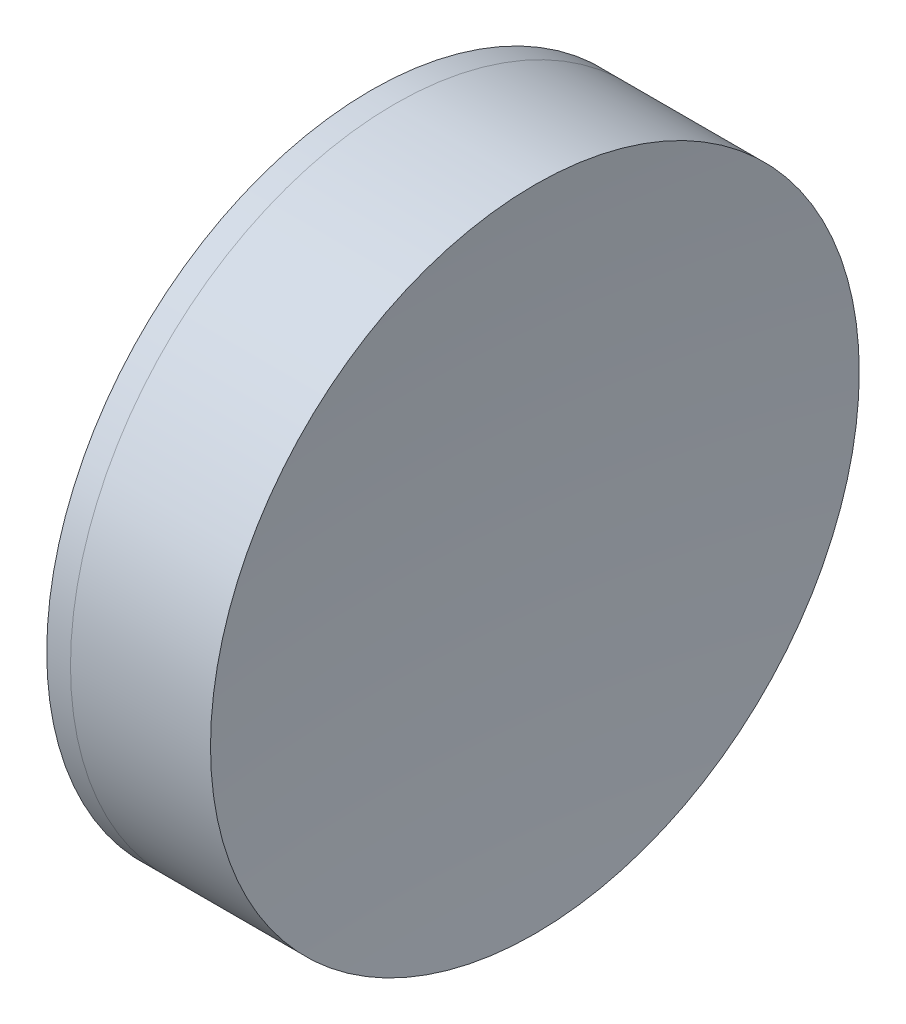
ISO-10303-21;
HEADER;
FILE_DESCRIPTION(('STEP AP214'),'2;1');
FILE_NAME('part.step','',(''),(''),'','','');
FILE_SCHEMA(('AUTOMOTIVE_DESIGN { 1 0 10303 214 1 1 1 1 }'));
ENDSEC;
DATA;
#1=APPLICATION_CONTEXT('core data for automotive mechanical design processes');
#2=APPLICATION_PROTOCOL_DEFINITION('international standard','automotive_design',2000,#1);
#3=PRODUCT_CONTEXT('',#1,'mechanical');
#4=PRODUCT('Part','Part','',(#3));
#5=PRODUCT_RELATED_PRODUCT_CATEGORY('part','',(#4));
#6=PRODUCT_DEFINITION_FORMATION('','',#4);
#7=PRODUCT_DEFINITION_CONTEXT('part definition',#1,'design');
#8=PRODUCT_DEFINITION('design','',#6,#7);
#9=PRODUCT_DEFINITION_SHAPE('','',#8);
#10=(LENGTH_UNIT() NAMED_UNIT(*) SI_UNIT(.MILLI.,.METRE.));
#11=(NAMED_UNIT(*) PLANE_ANGLE_UNIT() SI_UNIT($,.RADIAN.));
#12=(NAMED_UNIT(*) SI_UNIT($,.STERADIAN.) SOLID_ANGLE_UNIT());
#13=UNCERTAINTY_MEASURE_WITH_UNIT(LENGTH_MEASURE(1.E-05),#10,'distance_accuracy_value','');
#14=(GEOMETRIC_REPRESENTATION_CONTEXT(3) GLOBAL_UNCERTAINTY_ASSIGNED_CONTEXT((#13)) GLOBAL_UNIT_ASSIGNED_CONTEXT((#10,
#11,#12)) REPRESENTATION_CONTEXT('',''));
#15=CARTESIAN_POINT('',(0.,0.,0.));
#16=DIRECTION('',(0.,0.,1.));
#17=DIRECTION('',(1.,0.,0.));
#18=AXIS2_PLACEMENT_3D('',#15,#16,#17);
#19=CARTESIAN_POINT('',(62.590344632978,0.,0.));
#20=DIRECTION('',(-1.,0.,0.));
#21=DIRECTION('',(0.,0.,1.));
#22=AXIS2_PLACEMENT_3D('',#19,#20,#21);
#23=SPHERICAL_SURFACE('',#22,48.31);
#24=CARTESIAN_POINT('',(103.684092332598,0.,0.));
#25=DIRECTION('',(-1.,0.,0.));
#26=DIRECTION('',(0.,0.,1.));
#27=AXIS2_PLACEMENT_3D('',#24,#25,#26);
#28=CIRCLE('',#27,25.4);
#29=CARTESIAN_POINT('',(103.684092332598,0.,25.4));
#30=VERTEX_POINT('',#29);
#31=EDGE_CURVE('E55',#30,#30,#28,.T.);
#32=ORIENTED_EDGE('',*,*,#31,.T.);
#33=EDGE_LOOP('',(#32));
#34=FACE_BOUND('',#33,.T.);
#35=ADVANCED_FACE('F49',(#34),#23,.F.);
#36=CARTESIAN_POINT('',(372.800344632978,0.,0.));
#37=DIRECTION('',(-1.,0.,0.));
#38=DIRECTION('',(0.,0.,-1.));
#39=AXIS2_PLACEMENT_3D('',#36,#37,#38);
#40=SPHERICAL_SURFACE('',#39,259.4);
#41=CARTESIAN_POINT('',(114.646901890101,0.,0.));
#42=DIRECTION('',(-1.,0.,0.));
#43=DIRECTION('',(0.,0.,1.));
#44=AXIS2_PLACEMENT_3D('',#41,#42,#43);
#45=CIRCLE('',#44,25.4);
#46=CARTESIAN_POINT('',(114.646901890101,0.,25.4));
#47=VERTEX_POINT('',#46);
#48=EDGE_CURVE('E11',#47,#47,#45,.T.);
#49=ORIENTED_EDGE('',*,*,#48,.F.);
#50=EDGE_LOOP('',(#49));
#51=FACE_BOUND('',#50,.T.);
#52=ADVANCED_FACE('F64',(#51),#40,.F.);
#53=CARTESIAN_POINT('',(-0.551919992657797,0.,0.));
#54=DIRECTION('',(-1.,0.,0.));
#55=DIRECTION('',(0.,0.,1.));
#56=AXIS2_PLACEMENT_3D('',#53,#54,#55);
#57=CYLINDRICAL_SURFACE('',#56,25.4);
#58=ORIENTED_EDGE('',*,*,#48,.T.);
#59=EDGE_LOOP('',(#58));
#60=FACE_BOUND('',#59,.T.);
#61=ORIENTED_EDGE('',*,*,#31,.F.);
#62=EDGE_LOOP('',(#61));
#63=FACE_BOUND('',#62,.T.);
#64=ADVANCED_FACE('F62',(#60,#63),#57,.T.);
#65=CLOSED_SHELL('',(#35,#52,#64));
#66=MANIFOLD_SOLID_BREP('B2',#65);
#67=CARTESIAN_POINT('',(138.570344632978,0.,0.));
#68=DIRECTION('',(-1.,0.,0.));
#69=DIRECTION('',(0.,0.,1.));
#70=AXIS2_PLACEMENT_3D('',#67,#68,#69);
#71=SPHERICAL_SURFACE('',#70,44.67);
#72=CARTESIAN_POINT('',(101.824611547353,0.,0.));
#73=DIRECTION('',(-1.,0.,0.));
#74=DIRECTION('',(0.,0.,1.));
#75=AXIS2_PLACEMENT_3D('',#72,#73,#74);
#76=CIRCLE('',#75,25.4);
#77=CARTESIAN_POINT('',(101.824611547353,0.,25.4));
#78=VERTEX_POINT('',#77);
#79=EDGE_CURVE('E48',#78,#78,#76,.T.);
#80=ORIENTED_EDGE('',*,*,#79,.T.);
#81=EDGE_LOOP('',(#80));
#82=FACE_BOUND('',#81,.T.);
#83=ADVANCED_FACE('F92',(#82),#71,.T.);
#84=CARTESIAN_POINT('',(-0.816062176165804,0.,0.));
#85=DIRECTION('',(-1.,0.,0.));
#86=DIRECTION('',(0.,0.,1.));
#87=AXIS2_PLACEMENT_3D('',#84,#85,#86);
#88=CYLINDRICAL_SURFACE('',#87,25.4);
#89=CARTESIAN_POINT('',(103.684092332598,0.,0.));
#90=DIRECTION('',(-1.,0.,0.));
#91=DIRECTION('',(0.,0.,1.));
#92=AXIS2_PLACEMENT_3D('',#89,#90,#91);
#93=CIRCLE('',#92,25.4);
#94=CARTESIAN_POINT('',(103.684092332598,0.,25.4));
#95=VERTEX_POINT('',#94);
#96=EDGE_CURVE('E98',#95,#95,#93,.T.);
#97=ORIENTED_EDGE('',*,*,#96,.T.);
#98=EDGE_LOOP('',(#97));
#99=FACE_BOUND('',#98,.T.);
#100=ORIENTED_EDGE('',*,*,#79,.F.);
#101=EDGE_LOOP('',(#100));
#102=FACE_BOUND('',#101,.T.);
#103=ADVANCED_FACE('F104',(#99,#102),#88,.T.);
#104=CARTESIAN_POINT('',(62.590344632978,0.,0.));
#105=DIRECTION('',(-1.,0.,0.));
#106=DIRECTION('',(0.,0.,1.));
#107=AXIS2_PLACEMENT_3D('',#104,#105,#106);
#108=SPHERICAL_SURFACE('',#107,48.31);
#109=ORIENTED_EDGE('',*,*,#96,.F.);
#110=EDGE_LOOP('',(#109));
#111=FACE_BOUND('',#110,.T.);
#112=ADVANCED_FACE('F107',(#111),#108,.T.);
#113=CLOSED_SHELL('',(#83,#103,#112));
#114=MANIFOLD_SOLID_BREP('B6',#113);
#115=ADVANCED_BREP_SHAPE_REPRESENTATION('',(#18,#66,#114),#14);
#116=SHAPE_DEFINITION_REPRESENTATION(#9,#115);
ENDSEC;
END-ISO-10303-21;
